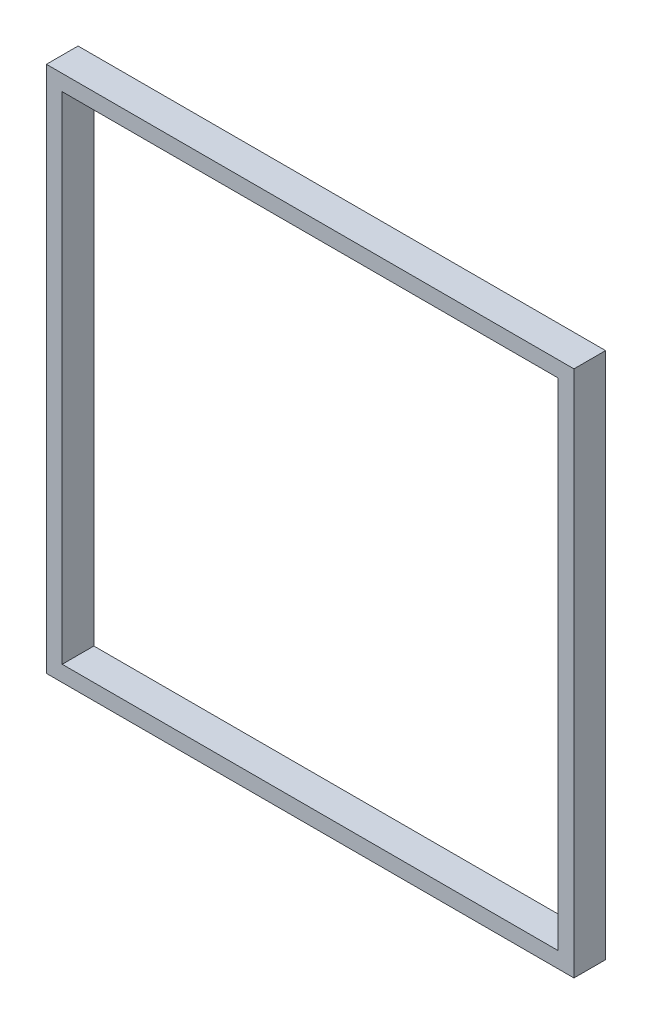
ISO-10303-21;
HEADER;
FILE_DESCRIPTION(('STEP AP214'),'2;1');
FILE_NAME('part.step','',(''),(''),'','','');
FILE_SCHEMA(('AUTOMOTIVE_DESIGN { 1 0 10303 214 1 1 1 1 }'));
ENDSEC;
DATA;
#1=APPLICATION_CONTEXT('core data for automotive mechanical design processes');
#2=APPLICATION_PROTOCOL_DEFINITION('international standard','automotive_design',2000,#1);
#3=PRODUCT_CONTEXT('',#1,'mechanical');
#4=PRODUCT('Part','Part','',(#3));
#5=PRODUCT_RELATED_PRODUCT_CATEGORY('part','',(#4));
#6=PRODUCT_DEFINITION_FORMATION('','',#4);
#7=PRODUCT_DEFINITION_CONTEXT('part definition',#1,'design');
#8=PRODUCT_DEFINITION('design','',#6,#7);
#9=PRODUCT_DEFINITION_SHAPE('','',#8);
#10=(LENGTH_UNIT() NAMED_UNIT(*) SI_UNIT(.MILLI.,.METRE.));
#11=(NAMED_UNIT(*) PLANE_ANGLE_UNIT() SI_UNIT($,.RADIAN.));
#12=(NAMED_UNIT(*) SI_UNIT($,.STERADIAN.) SOLID_ANGLE_UNIT());
#13=UNCERTAINTY_MEASURE_WITH_UNIT(LENGTH_MEASURE(1.E-05),#10,'distance_accuracy_value','');
#14=(GEOMETRIC_REPRESENTATION_CONTEXT(3) GLOBAL_UNCERTAINTY_ASSIGNED_CONTEXT((#13)) GLOBAL_UNIT_ASSIGNED_CONTEXT((#10,
#11,#12)) REPRESENTATION_CONTEXT('',''));
#15=CARTESIAN_POINT('',(0.,0.,0.));
#16=DIRECTION('',(0.,0.,1.));
#17=DIRECTION('',(1.,0.,0.));
#18=AXIS2_PLACEMENT_3D('',#15,#16,#17);
#19=CARTESIAN_POINT('',(0.,0.,3.));
#20=DIRECTION('',(0.,0.,-1.));
#21=DIRECTION('',(-1.,0.,0.));
#22=AXIS2_PLACEMENT_3D('',#19,#20,#21);
#23=PLANE('',#22);
#24=DIRECTION('',(0.,-1.,0.));
#25=VECTOR('',#24,1.);
#26=CARTESIAN_POINT('',(0.,0.,3.));
#27=LINE('',#26,#25);
#28=CARTESIAN_POINT('',(0.,50.,3.));
#29=VERTEX_POINT('',#28);
#30=CARTESIAN_POINT('',(0.,0.,3.));
#31=VERTEX_POINT('',#30);
#32=EDGE_CURVE('E134',#29,#31,#27,.T.);
#33=ORIENTED_EDGE('',*,*,#32,.T.);
#34=DIRECTION('',(1.,0.,0.));
#35=VECTOR('',#34,1.);
#36=CARTESIAN_POINT('',(0.,0.,3.));
#37=LINE('',#36,#35);
#38=CARTESIAN_POINT('',(50.,0.,3.));
#39=VERTEX_POINT('',#38);
#40=EDGE_CURVE('E137',#31,#39,#37,.T.);
#41=ORIENTED_EDGE('',*,*,#40,.T.);
#42=DIRECTION('',(0.,1.,0.));
#43=VECTOR('',#42,1.);
#44=CARTESIAN_POINT('',(50.,0.,3.));
#45=LINE('',#44,#43);
#46=CARTESIAN_POINT('',(50.,50.,3.));
#47=VERTEX_POINT('',#46);
#48=EDGE_CURVE('E140',#39,#47,#45,.T.);
#49=ORIENTED_EDGE('',*,*,#48,.T.);
#50=DIRECTION('',(-1.,0.,0.));
#51=VECTOR('',#50,1.);
#52=CARTESIAN_POINT('',(0.,50.,3.));
#53=LINE('',#52,#51);
#54=EDGE_CURVE('E142',#47,#29,#53,.T.);
#55=ORIENTED_EDGE('',*,*,#54,.T.);
#56=EDGE_LOOP('',(#33,#41,#49,#55));
#57=FACE_BOUND('',#56,.T.);
#58=DIRECTION('',(0.,-1.,0.));
#59=VECTOR('',#58,1.);
#60=CARTESIAN_POINT('',(1.5,1.5,3.));
#61=LINE('',#60,#59);
#62=CARTESIAN_POINT('',(1.5,48.5,3.));
#63=VERTEX_POINT('',#62);
#64=CARTESIAN_POINT('',(1.5,1.5,3.));
#65=VERTEX_POINT('',#64);
#66=EDGE_CURVE('E98',#63,#65,#61,.T.);
#67=ORIENTED_EDGE('',*,*,#66,.F.);
#68=DIRECTION('',(-1.,0.,0.));
#69=VECTOR('',#68,1.);
#70=CARTESIAN_POINT('',(1.5,48.5,3.));
#71=LINE('',#70,#69);
#72=CARTESIAN_POINT('',(48.5,48.5,3.));
#73=VERTEX_POINT('',#72);
#74=EDGE_CURVE('E120',#73,#63,#71,.T.);
#75=ORIENTED_EDGE('',*,*,#74,.F.);
#76=DIRECTION('',(0.,1.,0.));
#77=VECTOR('',#76,1.);
#78=CARTESIAN_POINT('',(48.5,1.5,3.));
#79=LINE('',#78,#77);
#80=CARTESIAN_POINT('',(48.5,1.5,3.));
#81=VERTEX_POINT('',#80);
#82=EDGE_CURVE('E118',#81,#73,#79,.T.);
#83=ORIENTED_EDGE('',*,*,#82,.F.);
#84=DIRECTION('',(1.,0.,0.));
#85=VECTOR('',#84,1.);
#86=CARTESIAN_POINT('',(1.5,1.5,3.));
#87=LINE('',#86,#85);
#88=EDGE_CURVE('E106',#65,#81,#87,.T.);
#89=ORIENTED_EDGE('',*,*,#88,.F.);
#90=EDGE_LOOP('',(#67,#75,#83,#89));
#91=FACE_BOUND('',#90,.T.);
#92=ADVANCED_FACE('F33',(#57,#91),#23,.F.);
#93=CARTESIAN_POINT('',(0.,0.,0.));
#94=DIRECTION('',(0.,0.,-1.));
#95=DIRECTION('',(-1.,0.,0.));
#96=AXIS2_PLACEMENT_3D('',#93,#94,#95);
#97=PLANE('',#96);
#98=DIRECTION('',(0.,-1.,0.));
#99=VECTOR('',#98,1.);
#100=CARTESIAN_POINT('',(0.,0.,0.));
#101=LINE('',#100,#99);
#102=CARTESIAN_POINT('',(0.,50.,0.));
#103=VERTEX_POINT('',#102);
#104=CARTESIAN_POINT('',(0.,0.,0.));
#105=VERTEX_POINT('',#104);
#106=EDGE_CURVE('E114',#103,#105,#101,.T.);
#107=ORIENTED_EDGE('',*,*,#106,.F.);
#108=DIRECTION('',(-1.,0.,0.));
#109=VECTOR('',#108,1.);
#110=CARTESIAN_POINT('',(0.,50.,0.));
#111=LINE('',#110,#109);
#112=CARTESIAN_POINT('',(50.,50.,0.));
#113=VERTEX_POINT('',#112);
#114=EDGE_CURVE('E138',#113,#103,#111,.T.);
#115=ORIENTED_EDGE('',*,*,#114,.F.);
#116=DIRECTION('',(0.,1.,0.));
#117=VECTOR('',#116,1.);
#118=CARTESIAN_POINT('',(50.,0.,0.));
#119=LINE('',#118,#117);
#120=CARTESIAN_POINT('',(50.,0.,0.));
#121=VERTEX_POINT('',#120);
#122=EDGE_CURVE('E149',#121,#113,#119,.T.);
#123=ORIENTED_EDGE('',*,*,#122,.F.);
#124=DIRECTION('',(1.,0.,0.));
#125=VECTOR('',#124,1.);
#126=CARTESIAN_POINT('',(0.,0.,0.));
#127=LINE('',#126,#125);
#128=EDGE_CURVE('E147',#105,#121,#127,.T.);
#129=ORIENTED_EDGE('',*,*,#128,.F.);
#130=EDGE_LOOP('',(#107,#115,#123,#129));
#131=FACE_BOUND('',#130,.T.);
#132=DIRECTION('',(-1.,0.,0.));
#133=VECTOR('',#132,1.);
#134=CARTESIAN_POINT('',(1.5,48.5,0.));
#135=LINE('',#134,#133);
#136=CARTESIAN_POINT('',(48.5,48.5,0.));
#137=VERTEX_POINT('',#136);
#138=CARTESIAN_POINT('',(1.5,48.5,0.));
#139=VERTEX_POINT('',#138);
#140=EDGE_CURVE('E107',#137,#139,#135,.T.);
#141=ORIENTED_EDGE('',*,*,#140,.T.);
#142=DIRECTION('',(0.,-1.,0.));
#143=VECTOR('',#142,1.);
#144=CARTESIAN_POINT('',(1.5,1.5,0.));
#145=LINE('',#144,#143);
#146=CARTESIAN_POINT('',(1.5,1.5,0.));
#147=VERTEX_POINT('',#146);
#148=EDGE_CURVE('E56',#139,#147,#145,.T.);
#149=ORIENTED_EDGE('',*,*,#148,.T.);
#150=DIRECTION('',(1.,0.,0.));
#151=VECTOR('',#150,1.);
#152=CARTESIAN_POINT('',(1.5,1.5,0.));
#153=LINE('',#152,#151);
#154=CARTESIAN_POINT('',(48.5,1.5,0.));
#155=VERTEX_POINT('',#154);
#156=EDGE_CURVE('E113',#147,#155,#153,.T.);
#157=ORIENTED_EDGE('',*,*,#156,.T.);
#158=DIRECTION('',(0.,1.,0.));
#159=VECTOR('',#158,1.);
#160=CARTESIAN_POINT('',(48.5,1.5,0.));
#161=LINE('',#160,#159);
#162=EDGE_CURVE('E126',#155,#137,#161,.T.);
#163=ORIENTED_EDGE('',*,*,#162,.T.);
#164=EDGE_LOOP('',(#141,#149,#157,#163));
#165=FACE_BOUND('',#164,.T.);
#166=ADVANCED_FACE('F167',(#131,#165),#97,.T.);
#167=CARTESIAN_POINT('',(0.,0.,3.));
#168=DIRECTION('',(1.,0.,0.));
#169=DIRECTION('',(0.,0.,-1.));
#170=AXIS2_PLACEMENT_3D('',#167,#168,#169);
#171=PLANE('',#170);
#172=ORIENTED_EDGE('',*,*,#106,.T.);
#173=DIRECTION('',(0.,0.,-1.));
#174=VECTOR('',#173,1.);
#175=CARTESIAN_POINT('',(0.,0.,3.));
#176=LINE('',#175,#174);
#177=EDGE_CURVE('E11',#31,#105,#176,.T.);
#178=ORIENTED_EDGE('',*,*,#177,.F.);
#179=ORIENTED_EDGE('',*,*,#32,.F.);
#180=DIRECTION('',(0.,0.,-1.));
#181=VECTOR('',#180,1.);
#182=CARTESIAN_POINT('',(0.,50.,3.));
#183=LINE('',#182,#181);
#184=EDGE_CURVE('E144',#29,#103,#183,.T.);
#185=ORIENTED_EDGE('',*,*,#184,.T.);
#186=EDGE_LOOP('',(#172,#178,#179,#185));
#187=FACE_BOUND('',#186,.T.);
#188=ADVANCED_FACE('F35',(#187),#171,.F.);
#189=CARTESIAN_POINT('',(0.,0.,3.));
#190=DIRECTION('',(0.,1.,0.));
#191=DIRECTION('',(0.,0.,1.));
#192=AXIS2_PLACEMENT_3D('',#189,#190,#191);
#193=PLANE('',#192);
#194=ORIENTED_EDGE('',*,*,#128,.T.);
#195=DIRECTION('',(0.,0.,-1.));
#196=VECTOR('',#195,1.);
#197=CARTESIAN_POINT('',(50.,0.,3.));
#198=LINE('',#197,#196);
#199=EDGE_CURVE('E41',#39,#121,#198,.T.);
#200=ORIENTED_EDGE('',*,*,#199,.F.);
#201=ORIENTED_EDGE('',*,*,#40,.F.);
#202=ORIENTED_EDGE('',*,*,#177,.T.);
#203=EDGE_LOOP('',(#194,#200,#201,#202));
#204=FACE_BOUND('',#203,.T.);
#205=ADVANCED_FACE('F177',(#204),#193,.F.);
#206=CARTESIAN_POINT('',(50.,0.,3.));
#207=DIRECTION('',(-1.,0.,0.));
#208=DIRECTION('',(0.,0.,1.));
#209=AXIS2_PLACEMENT_3D('',#206,#207,#208);
#210=PLANE('',#209);
#211=ORIENTED_EDGE('',*,*,#122,.T.);
#212=DIRECTION('',(0.,0.,-1.));
#213=VECTOR('',#212,1.);
#214=CARTESIAN_POINT('',(50.,50.,3.));
#215=LINE('',#214,#213);
#216=EDGE_CURVE('E154',#47,#113,#215,.T.);
#217=ORIENTED_EDGE('',*,*,#216,.F.);
#218=ORIENTED_EDGE('',*,*,#48,.F.);
#219=ORIENTED_EDGE('',*,*,#199,.T.);
#220=EDGE_LOOP('',(#211,#217,#218,#219));
#221=FACE_BOUND('',#220,.T.);
#222=ADVANCED_FACE('F161',(#221),#210,.F.);
#223=CARTESIAN_POINT('',(0.,50.,3.));
#224=DIRECTION('',(0.,-1.,0.));
#225=DIRECTION('',(0.,0.,-1.));
#226=AXIS2_PLACEMENT_3D('',#223,#224,#225);
#227=PLANE('',#226);
#228=ORIENTED_EDGE('',*,*,#114,.T.);
#229=ORIENTED_EDGE('',*,*,#184,.F.);
#230=ORIENTED_EDGE('',*,*,#54,.F.);
#231=ORIENTED_EDGE('',*,*,#216,.T.);
#232=EDGE_LOOP('',(#228,#229,#230,#231));
#233=FACE_BOUND('',#232,.T.);
#234=ADVANCED_FACE('F171',(#233),#227,.F.);
#235=CARTESIAN_POINT('',(1.5,1.5,3.));
#236=DIRECTION('',(1.,0.,0.));
#237=DIRECTION('',(0.,0.,-1.));
#238=AXIS2_PLACEMENT_3D('',#235,#236,#237);
#239=PLANE('',#238);
#240=ORIENTED_EDGE('',*,*,#148,.F.);
#241=DIRECTION('',(0.,0.,-1.));
#242=VECTOR('',#241,1.);
#243=CARTESIAN_POINT('',(1.5,48.5,3.));
#244=LINE('',#243,#242);
#245=EDGE_CURVE('E102',#63,#139,#244,.T.);
#246=ORIENTED_EDGE('',*,*,#245,.F.);
#247=ORIENTED_EDGE('',*,*,#66,.T.);
#248=DIRECTION('',(0.,0.,-1.));
#249=VECTOR('',#248,1.);
#250=CARTESIAN_POINT('',(1.5,1.5,3.));
#251=LINE('',#250,#249);
#252=EDGE_CURVE('E101',#65,#147,#251,.T.);
#253=ORIENTED_EDGE('',*,*,#252,.T.);
#254=EDGE_LOOP('',(#240,#246,#247,#253));
#255=FACE_BOUND('',#254,.T.);
#256=ADVANCED_FACE('F100',(#255),#239,.T.);
#257=CARTESIAN_POINT('',(1.5,1.5,3.));
#258=DIRECTION('',(0.,1.,0.));
#259=DIRECTION('',(0.,0.,1.));
#260=AXIS2_PLACEMENT_3D('',#257,#258,#259);
#261=PLANE('',#260);
#262=ORIENTED_EDGE('',*,*,#156,.F.);
#263=ORIENTED_EDGE('',*,*,#252,.F.);
#264=ORIENTED_EDGE('',*,*,#88,.T.);
#265=DIRECTION('',(0.,0.,-1.));
#266=VECTOR('',#265,1.);
#267=CARTESIAN_POINT('',(48.5,1.5,3.));
#268=LINE('',#267,#266);
#269=EDGE_CURVE('E115',#81,#155,#268,.T.);
#270=ORIENTED_EDGE('',*,*,#269,.T.);
#271=EDGE_LOOP('',(#262,#263,#264,#270));
#272=FACE_BOUND('',#271,.T.);
#273=ADVANCED_FACE('F110',(#272),#261,.T.);
#274=CARTESIAN_POINT('',(48.5,1.5,3.));
#275=DIRECTION('',(-1.,0.,0.));
#276=DIRECTION('',(0.,0.,1.));
#277=AXIS2_PLACEMENT_3D('',#274,#275,#276);
#278=PLANE('',#277);
#279=ORIENTED_EDGE('',*,*,#162,.F.);
#280=ORIENTED_EDGE('',*,*,#269,.F.);
#281=ORIENTED_EDGE('',*,*,#82,.T.);
#282=DIRECTION('',(0.,0.,-1.));
#283=VECTOR('',#282,1.);
#284=CARTESIAN_POINT('',(48.5,48.5,3.));
#285=LINE('',#284,#283);
#286=EDGE_CURVE('E48',#73,#137,#285,.T.);
#287=ORIENTED_EDGE('',*,*,#286,.T.);
#288=EDGE_LOOP('',(#279,#280,#281,#287));
#289=FACE_BOUND('',#288,.T.);
#290=ADVANCED_FACE('F200',(#289),#278,.T.);
#291=CARTESIAN_POINT('',(1.5,48.5,3.));
#292=DIRECTION('',(0.,-1.,0.));
#293=DIRECTION('',(0.,0.,-1.));
#294=AXIS2_PLACEMENT_3D('',#291,#292,#293);
#295=PLANE('',#294);
#296=ORIENTED_EDGE('',*,*,#140,.F.);
#297=ORIENTED_EDGE('',*,*,#286,.F.);
#298=ORIENTED_EDGE('',*,*,#74,.T.);
#299=ORIENTED_EDGE('',*,*,#245,.T.);
#300=EDGE_LOOP('',(#296,#297,#298,#299));
#301=FACE_BOUND('',#300,.T.);
#302=ADVANCED_FACE('F204',(#301),#295,.T.);
#303=CLOSED_SHELL('',(#92,#166,#188,#205,#222,#234,#256,#273,#290,#302));
#304=MANIFOLD_SOLID_BREP('B2',#303);
#305=ADVANCED_BREP_SHAPE_REPRESENTATION('',(#18,#304),#14);
#306=SHAPE_DEFINITION_REPRESENTATION(#9,#305);
ENDSEC;
END-ISO-10303-21;
